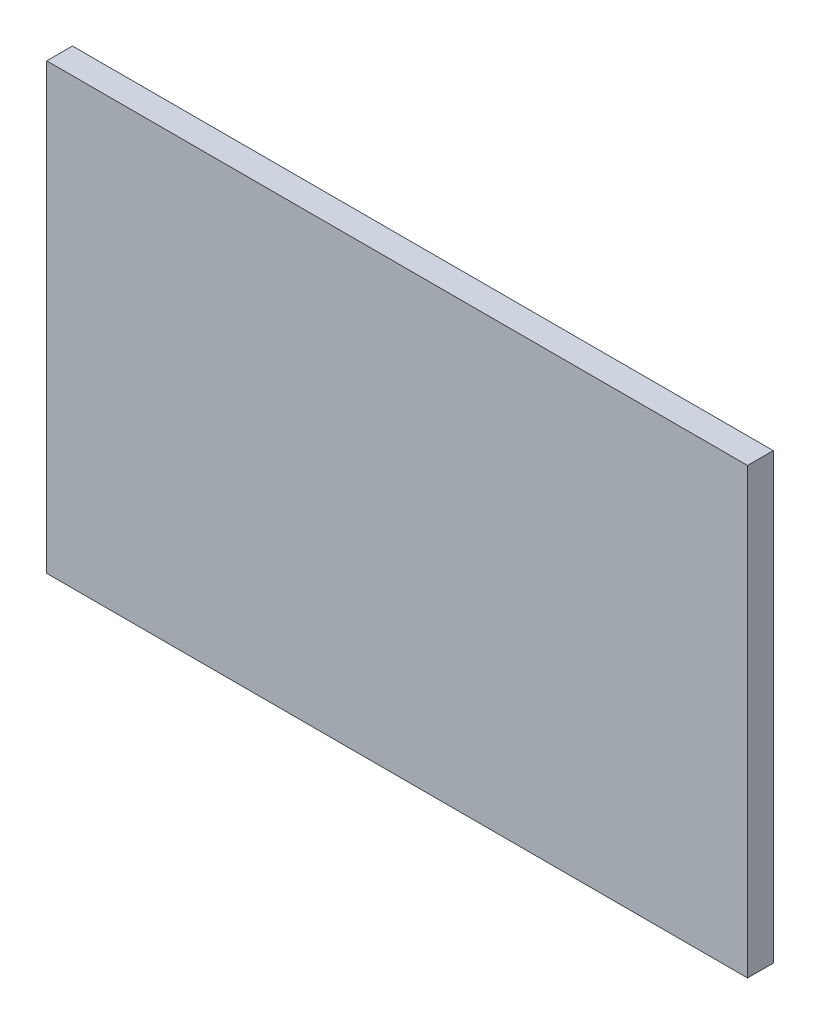
ISO-10303-21;
HEADER;
FILE_DESCRIPTION(('STEP AP214'),'2;1');
FILE_NAME('part.step','',(''),(''),'','','');
FILE_SCHEMA(('AUTOMOTIVE_DESIGN { 1 0 10303 214 1 1 1 1 }'));
ENDSEC;
DATA;
#1=APPLICATION_CONTEXT('core data for automotive mechanical design processes');
#2=APPLICATION_PROTOCOL_DEFINITION('international standard','automotive_design',2000,#1);
#3=PRODUCT_CONTEXT('',#1,'mechanical');
#4=PRODUCT('Part','Part','',(#3));
#5=PRODUCT_RELATED_PRODUCT_CATEGORY('part','',(#4));
#6=PRODUCT_DEFINITION_FORMATION('','',#4);
#7=PRODUCT_DEFINITION_CONTEXT('part definition',#1,'design');
#8=PRODUCT_DEFINITION('design','',#6,#7);
#9=PRODUCT_DEFINITION_SHAPE('','',#8);
#10=(LENGTH_UNIT() NAMED_UNIT(*) SI_UNIT(.MILLI.,.METRE.));
#11=(NAMED_UNIT(*) PLANE_ANGLE_UNIT() SI_UNIT($,.RADIAN.));
#12=(NAMED_UNIT(*) SI_UNIT($,.STERADIAN.) SOLID_ANGLE_UNIT());
#13=UNCERTAINTY_MEASURE_WITH_UNIT(LENGTH_MEASURE(1.E-05),#10,'distance_accuracy_value','');
#14=(GEOMETRIC_REPRESENTATION_CONTEXT(3) GLOBAL_UNCERTAINTY_ASSIGNED_CONTEXT((#13)) GLOBAL_UNIT_ASSIGNED_CONTEXT((#10,
#11,#12)) REPRESENTATION_CONTEXT('',''));
#15=CARTESIAN_POINT('',(0.,0.,0.));
#16=DIRECTION('',(0.,0.,1.));
#17=DIRECTION('',(1.,0.,0.));
#18=AXIS2_PLACEMENT_3D('',#15,#16,#17);
#19=CARTESIAN_POINT('',(0.,0.,0.055));
#20=DIRECTION('',(0.,0.,1.));
#21=DIRECTION('',(1.,0.,0.));
#22=AXIS2_PLACEMENT_3D('',#19,#20,#21);
#23=PLANE('',#22);
#24=DIRECTION('',(0.,1.,0.));
#25=VECTOR('',#24,1.);
#26=CARTESIAN_POINT('',(1.5,0.,0.055));
#27=LINE('',#26,#25);
#28=CARTESIAN_POINT('',(1.5,0.95,0.055));
#29=VERTEX_POINT('',#28);
#30=CARTESIAN_POINT('',(1.5,0.,0.055));
#31=VERTEX_POINT('',#30);
#32=EDGE_CURVE('E76',#29,#31,#27,.F.);
#33=ORIENTED_EDGE('',*,*,#32,.F.);
#34=DIRECTION('',(1.,0.,0.));
#35=VECTOR('',#34,1.);
#36=CARTESIAN_POINT('',(0.,0.95,0.055));
#37=LINE('',#36,#35);
#38=CARTESIAN_POINT('',(0.,0.95,0.055));
#39=VERTEX_POINT('',#38);
#40=EDGE_CURVE('E58',#39,#29,#37,.T.);
#41=ORIENTED_EDGE('',*,*,#40,.F.);
#42=DIRECTION('',(0.,1.,0.));
#43=VECTOR('',#42,1.);
#44=CARTESIAN_POINT('',(0.,0.,0.055));
#45=LINE('',#44,#43);
#46=CARTESIAN_POINT('',(0.,0.,0.055));
#47=VERTEX_POINT('',#46);
#48=EDGE_CURVE('E20',#39,#47,#45,.F.);
#49=ORIENTED_EDGE('',*,*,#48,.T.);
#50=DIRECTION('',(1.,0.,0.));
#51=VECTOR('',#50,1.);
#52=CARTESIAN_POINT('',(0.,0.,0.055));
#53=LINE('',#52,#51);
#54=EDGE_CURVE('E55',#47,#31,#53,.T.);
#55=ORIENTED_EDGE('',*,*,#54,.T.);
#56=EDGE_LOOP('',(#33,#41,#49,#55));
#57=FACE_BOUND('',#56,.T.);
#58=ADVANCED_FACE('F17',(#57),#23,.T.);
#59=CARTESIAN_POINT('',(0.,0.,0.));
#60=DIRECTION('',(1.,0.,0.));
#61=DIRECTION('',(0.,0.,-1.));
#62=AXIS2_PLACEMENT_3D('',#59,#60,#61);
#63=PLANE('',#62);
#64=DIRECTION('',(0.,0.,1.));
#65=VECTOR('',#64,1.);
#66=CARTESIAN_POINT('',(0.,0.95,0.));
#67=LINE('',#66,#65);
#68=CARTESIAN_POINT('',(0.,0.95,0.));
#69=VERTEX_POINT('',#68);
#70=EDGE_CURVE('E78',#69,#39,#67,.T.);
#71=ORIENTED_EDGE('',*,*,#70,.F.);
#72=DIRECTION('',(0.,1.,0.));
#73=VECTOR('',#72,1.);
#74=CARTESIAN_POINT('',(0.,0.,0.));
#75=LINE('',#74,#73);
#76=CARTESIAN_POINT('',(0.,0.,0.));
#77=VERTEX_POINT('',#76);
#78=EDGE_CURVE('E73',#69,#77,#75,.F.);
#79=ORIENTED_EDGE('',*,*,#78,.T.);
#80=DIRECTION('',(0.,0.,1.));
#81=VECTOR('',#80,1.);
#82=CARTESIAN_POINT('',(0.,0.,0.));
#83=LINE('',#82,#81);
#84=EDGE_CURVE('E63',#77,#47,#83,.T.);
#85=ORIENTED_EDGE('',*,*,#84,.T.);
#86=ORIENTED_EDGE('',*,*,#48,.F.);
#87=EDGE_LOOP('',(#71,#79,#85,#86));
#88=FACE_BOUND('',#87,.T.);
#89=ADVANCED_FACE('F72',(#88),#63,.F.);
#90=CARTESIAN_POINT('',(0.,0.,0.));
#91=DIRECTION('',(0.,1.,0.));
#92=DIRECTION('',(0.,0.,1.));
#93=AXIS2_PLACEMENT_3D('',#90,#91,#92);
#94=PLANE('',#93);
#95=ORIENTED_EDGE('',*,*,#54,.F.);
#96=ORIENTED_EDGE('',*,*,#84,.F.);
#97=DIRECTION('',(1.,0.,0.));
#98=VECTOR('',#97,1.);
#99=CARTESIAN_POINT('',(0.,0.,0.));
#100=LINE('',#99,#98);
#101=CARTESIAN_POINT('',(1.5,0.,0.));
#102=VERTEX_POINT('',#101);
#103=EDGE_CURVE('E83',#77,#102,#100,.T.);
#104=ORIENTED_EDGE('',*,*,#103,.T.);
#105=DIRECTION('',(0.,0.,-1.));
#106=VECTOR('',#105,1.);
#107=CARTESIAN_POINT('',(1.5,0.,0.));
#108=LINE('',#107,#106);
#109=EDGE_CURVE('E69',#31,#102,#108,.T.);
#110=ORIENTED_EDGE('',*,*,#109,.F.);
#111=EDGE_LOOP('',(#95,#96,#104,#110));
#112=FACE_BOUND('',#111,.T.);
#113=ADVANCED_FACE('F66',(#112),#94,.F.);
#114=CARTESIAN_POINT('',(1.5,0.,0.));
#115=DIRECTION('',(1.,0.,0.));
#116=DIRECTION('',(0.,0.,-1.));
#117=AXIS2_PLACEMENT_3D('',#114,#115,#116);
#118=PLANE('',#117);
#119=DIRECTION('',(0.,0.,1.));
#120=VECTOR('',#119,1.);
#121=CARTESIAN_POINT('',(1.5,0.95,0.));
#122=LINE('',#121,#120);
#123=CARTESIAN_POINT('',(1.5,0.95,0.));
#124=VERTEX_POINT('',#123);
#125=EDGE_CURVE('E34',#29,#124,#122,.F.);
#126=ORIENTED_EDGE('',*,*,#125,.F.);
#127=ORIENTED_EDGE('',*,*,#32,.T.);
#128=ORIENTED_EDGE('',*,*,#109,.T.);
#129=DIRECTION('',(0.,1.,0.));
#130=VECTOR('',#129,1.);
#131=CARTESIAN_POINT('',(1.5,0.,0.));
#132=LINE('',#131,#130);
#133=EDGE_CURVE('E26',#102,#124,#132,.T.);
#134=ORIENTED_EDGE('',*,*,#133,.T.);
#135=EDGE_LOOP('',(#126,#127,#128,#134));
#136=FACE_BOUND('',#135,.T.);
#137=ADVANCED_FACE('F88',(#136),#118,.T.);
#138=CARTESIAN_POINT('',(0.,0.95,0.));
#139=DIRECTION('',(0.,1.,0.));
#140=DIRECTION('',(0.,0.,1.));
#141=AXIS2_PLACEMENT_3D('',#138,#139,#140);
#142=PLANE('',#141);
#143=ORIENTED_EDGE('',*,*,#40,.T.);
#144=ORIENTED_EDGE('',*,*,#125,.T.);
#145=DIRECTION('',(1.,0.,0.));
#146=VECTOR('',#145,1.);
#147=CARTESIAN_POINT('',(0.,0.95,0.));
#148=LINE('',#147,#146);
#149=EDGE_CURVE('E11',#124,#69,#148,.F.);
#150=ORIENTED_EDGE('',*,*,#149,.T.);
#151=ORIENTED_EDGE('',*,*,#70,.T.);
#152=EDGE_LOOP('',(#143,#144,#150,#151));
#153=FACE_BOUND('',#152,.T.);
#154=ADVANCED_FACE('F91',(#153),#142,.T.);
#155=CARTESIAN_POINT('',(0.,0.,0.));
#156=DIRECTION('',(0.,0.,1.));
#157=DIRECTION('',(1.,0.,0.));
#158=AXIS2_PLACEMENT_3D('',#155,#156,#157);
#159=PLANE('',#158);
#160=ORIENTED_EDGE('',*,*,#133,.F.);
#161=ORIENTED_EDGE('',*,*,#103,.F.);
#162=ORIENTED_EDGE('',*,*,#78,.F.);
#163=ORIENTED_EDGE('',*,*,#149,.F.);
#164=EDGE_LOOP('',(#160,#161,#162,#163));
#165=FACE_BOUND('',#164,.T.);
#166=ADVANCED_FACE('F90',(#165),#159,.F.);
#167=CLOSED_SHELL('',(#58,#89,#113,#137,#154,#166));
#168=MANIFOLD_SOLID_BREP('B1',#167);
#169=ADVANCED_BREP_SHAPE_REPRESENTATION('',(#18,#168),#14);
#170=SHAPE_DEFINITION_REPRESENTATION(#9,#169);
ENDSEC;
END-ISO-10303-21;
